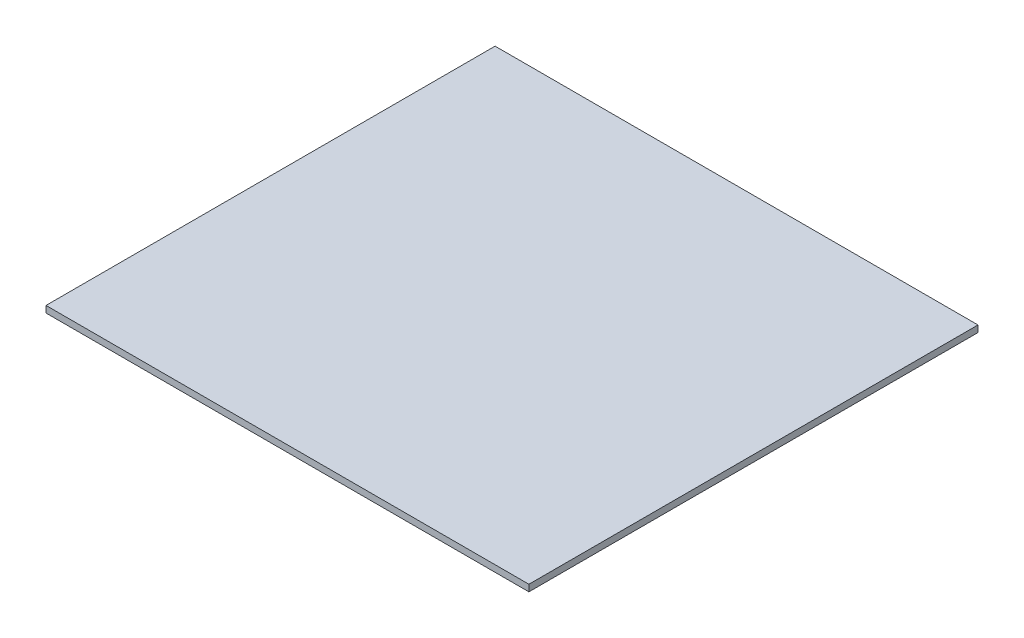
ISO-10303-21;
HEADER;
FILE_DESCRIPTION(('STEP AP214'),'2;1');
FILE_NAME('part.step','',(''),(''),'','','');
FILE_SCHEMA(('AUTOMOTIVE_DESIGN { 1 0 10303 214 1 1 1 1 }'));
ENDSEC;
DATA;
#1=APPLICATION_CONTEXT('core data for automotive mechanical design processes');
#2=APPLICATION_PROTOCOL_DEFINITION('international standard','automotive_design',2000,#1);
#3=PRODUCT_CONTEXT('',#1,'mechanical');
#4=PRODUCT('Part','Part','',(#3));
#5=PRODUCT_RELATED_PRODUCT_CATEGORY('part','',(#4));
#6=PRODUCT_DEFINITION_FORMATION('','',#4);
#7=PRODUCT_DEFINITION_CONTEXT('part definition',#1,'design');
#8=PRODUCT_DEFINITION('design','',#6,#7);
#9=PRODUCT_DEFINITION_SHAPE('','',#8);
#10=(LENGTH_UNIT() NAMED_UNIT(*) SI_UNIT(.MILLI.,.METRE.));
#11=(NAMED_UNIT(*) PLANE_ANGLE_UNIT() SI_UNIT($,.RADIAN.));
#12=(NAMED_UNIT(*) SI_UNIT($,.STERADIAN.) SOLID_ANGLE_UNIT());
#13=UNCERTAINTY_MEASURE_WITH_UNIT(LENGTH_MEASURE(1.E-05),#10,'distance_accuracy_value','');
#14=(GEOMETRIC_REPRESENTATION_CONTEXT(3) GLOBAL_UNCERTAINTY_ASSIGNED_CONTEXT((#13)) GLOBAL_UNIT_ASSIGNED_CONTEXT((#10,
#11,#12)) REPRESENTATION_CONTEXT('',''));
#15=CARTESIAN_POINT('',(0.,0.,0.));
#16=DIRECTION('',(0.,0.,1.));
#17=DIRECTION('',(1.,0.,0.));
#18=AXIS2_PLACEMENT_3D('',#15,#16,#17);
#19=CARTESIAN_POINT('',(0.,3.175,0.));
#20=DIRECTION('',(1.,0.,0.));
#21=DIRECTION('',(0.,0.,-1.));
#22=AXIS2_PLACEMENT_3D('',#19,#20,#21);
#23=PLANE('',#22);
#24=DIRECTION('',(0.,0.,1.));
#25=VECTOR('',#24,1.);
#26=CARTESIAN_POINT('',(0.,0.,0.));
#27=LINE('',#26,#25);
#28=CARTESIAN_POINT('',(0.,0.,-215.9));
#29=VERTEX_POINT('',#28);
#30=CARTESIAN_POINT('',(0.,0.,0.));
#31=VERTEX_POINT('',#30);
#32=EDGE_CURVE('E96',#29,#31,#27,.T.);
#33=ORIENTED_EDGE('',*,*,#32,.T.);
#34=DIRECTION('',(0.,-1.,0.));
#35=VECTOR('',#34,1.);
#36=CARTESIAN_POINT('',(0.,3.175,0.));
#37=LINE('',#36,#35);
#38=CARTESIAN_POINT('',(0.,3.175,0.));
#39=VERTEX_POINT('',#38);
#40=EDGE_CURVE('E11',#39,#31,#37,.T.);
#41=ORIENTED_EDGE('',*,*,#40,.F.);
#42=DIRECTION('',(0.,0.,1.));
#43=VECTOR('',#42,1.);
#44=CARTESIAN_POINT('',(0.,3.175,0.));
#45=LINE('',#44,#43);
#46=CARTESIAN_POINT('',(0.,3.175,-215.9));
#47=VERTEX_POINT('',#46);
#48=EDGE_CURVE('E84',#47,#39,#45,.T.);
#49=ORIENTED_EDGE('',*,*,#48,.F.);
#50=DIRECTION('',(0.,-1.,0.));
#51=VECTOR('',#50,1.);
#52=CARTESIAN_POINT('',(0.,3.175,-215.9));
#53=LINE('',#52,#51);
#54=EDGE_CURVE('E92',#47,#29,#53,.T.);
#55=ORIENTED_EDGE('',*,*,#54,.T.);
#56=EDGE_LOOP('',(#33,#41,#49,#55));
#57=FACE_BOUND('',#56,.T.);
#58=ADVANCED_FACE('F33',(#57),#23,.F.);
#59=CARTESIAN_POINT('',(0.,3.175,0.));
#60=DIRECTION('',(0.,0.,-1.));
#61=DIRECTION('',(-1.,0.,0.));
#62=AXIS2_PLACEMENT_3D('',#59,#60,#61);
#63=PLANE('',#62);
#64=DIRECTION('',(1.,0.,0.));
#65=VECTOR('',#64,1.);
#66=CARTESIAN_POINT('',(0.,0.,0.));
#67=LINE('',#66,#65);
#68=CARTESIAN_POINT('',(232.156,0.,0.));
#69=VERTEX_POINT('',#68);
#70=EDGE_CURVE('E88',#31,#69,#67,.T.);
#71=ORIENTED_EDGE('',*,*,#70,.T.);
#72=DIRECTION('',(0.,-1.,0.));
#73=VECTOR('',#72,1.);
#74=CARTESIAN_POINT('',(232.156,3.175,0.));
#75=LINE('',#74,#73);
#76=CARTESIAN_POINT('',(232.156,3.175,0.));
#77=VERTEX_POINT('',#76);
#78=EDGE_CURVE('E41',#77,#69,#75,.T.);
#79=ORIENTED_EDGE('',*,*,#78,.F.);
#80=DIRECTION('',(1.,0.,0.));
#81=VECTOR('',#80,1.);
#82=CARTESIAN_POINT('',(0.,3.175,0.));
#83=LINE('',#82,#81);
#84=EDGE_CURVE('E79',#39,#77,#83,.T.);
#85=ORIENTED_EDGE('',*,*,#84,.F.);
#86=ORIENTED_EDGE('',*,*,#40,.T.);
#87=EDGE_LOOP('',(#71,#79,#85,#86));
#88=FACE_BOUND('',#87,.T.);
#89=ADVANCED_FACE('F87',(#88),#63,.F.);
#90=CARTESIAN_POINT('',(232.156,3.175,-215.9));
#91=DIRECTION('',(-1.,0.,0.));
#92=DIRECTION('',(0.,0.,1.));
#93=AXIS2_PLACEMENT_3D('',#90,#91,#92);
#94=PLANE('',#93);
#95=DIRECTION('',(0.,0.,-1.));
#96=VECTOR('',#95,1.);
#97=CARTESIAN_POINT('',(232.156,0.,-215.9));
#98=LINE('',#97,#96);
#99=CARTESIAN_POINT('',(232.156,0.,-215.9));
#100=VERTEX_POINT('',#99);
#101=EDGE_CURVE('E66',#69,#100,#98,.T.);
#102=ORIENTED_EDGE('',*,*,#101,.T.);
#103=DIRECTION('',(0.,-1.,0.));
#104=VECTOR('',#103,1.);
#105=CARTESIAN_POINT('',(232.156,3.175,-215.9));
#106=LINE('',#105,#104);
#107=CARTESIAN_POINT('',(232.156,3.175,-215.9));
#108=VERTEX_POINT('',#107);
#109=EDGE_CURVE('E89',#108,#100,#106,.T.);
#110=ORIENTED_EDGE('',*,*,#109,.F.);
#111=DIRECTION('',(0.,0.,-1.));
#112=VECTOR('',#111,1.);
#113=CARTESIAN_POINT('',(232.156,3.175,-215.9));
#114=LINE('',#113,#112);
#115=EDGE_CURVE('E82',#77,#108,#114,.T.);
#116=ORIENTED_EDGE('',*,*,#115,.F.);
#117=ORIENTED_EDGE('',*,*,#78,.T.);
#118=EDGE_LOOP('',(#102,#110,#116,#117));
#119=FACE_BOUND('',#118,.T.);
#120=ADVANCED_FACE('F90',(#119),#94,.F.);
#121=CARTESIAN_POINT('',(0.,3.175,-215.9));
#122=DIRECTION('',(0.,0.,1.));
#123=DIRECTION('',(1.,0.,0.));
#124=AXIS2_PLACEMENT_3D('',#121,#122,#123);
#125=PLANE('',#124);
#126=DIRECTION('',(-1.,0.,0.));
#127=VECTOR('',#126,1.);
#128=CARTESIAN_POINT('',(0.,0.,-215.9));
#129=LINE('',#128,#127);
#130=EDGE_CURVE('E72',#100,#29,#129,.T.);
#131=ORIENTED_EDGE('',*,*,#130,.T.);
#132=ORIENTED_EDGE('',*,*,#54,.F.);
#133=DIRECTION('',(-1.,0.,0.));
#134=VECTOR('',#133,1.);
#135=CARTESIAN_POINT('',(0.,3.175,-215.9));
#136=LINE('',#135,#134);
#137=EDGE_CURVE('E49',#108,#47,#136,.T.);
#138=ORIENTED_EDGE('',*,*,#137,.F.);
#139=ORIENTED_EDGE('',*,*,#109,.T.);
#140=EDGE_LOOP('',(#131,#132,#138,#139));
#141=FACE_BOUND('',#140,.T.);
#142=ADVANCED_FACE('F103',(#141),#125,.F.);
#143=CARTESIAN_POINT('',(0.,3.175,0.));
#144=DIRECTION('',(0.,-1.,0.));
#145=DIRECTION('',(0.,0.,-1.));
#146=AXIS2_PLACEMENT_3D('',#143,#144,#145);
#147=PLANE('',#146);
#148=ORIENTED_EDGE('',*,*,#48,.T.);
#149=ORIENTED_EDGE('',*,*,#84,.T.);
#150=ORIENTED_EDGE('',*,*,#115,.T.);
#151=ORIENTED_EDGE('',*,*,#137,.T.);
#152=EDGE_LOOP('',(#148,#149,#150,#151));
#153=FACE_BOUND('',#152,.T.);
#154=ADVANCED_FACE('F80',(#153),#147,.F.);
#155=CARTESIAN_POINT('',(0.,0.,0.));
#156=DIRECTION('',(0.,-1.,0.));
#157=DIRECTION('',(0.,0.,-1.));
#158=AXIS2_PLACEMENT_3D('',#155,#156,#157);
#159=PLANE('',#158);
#160=ORIENTED_EDGE('',*,*,#32,.F.);
#161=ORIENTED_EDGE('',*,*,#130,.F.);
#162=ORIENTED_EDGE('',*,*,#101,.F.);
#163=ORIENTED_EDGE('',*,*,#70,.F.);
#164=EDGE_LOOP('',(#160,#161,#162,#163));
#165=FACE_BOUND('',#164,.T.);
#166=ADVANCED_FACE('F106',(#165),#159,.T.);
#167=CLOSED_SHELL('',(#58,#89,#120,#142,#154,#166));
#168=MANIFOLD_SOLID_BREP('B2',#167);
#169=ADVANCED_BREP_SHAPE_REPRESENTATION('',(#18,#168),#14);
#170=SHAPE_DEFINITION_REPRESENTATION(#9,#169);
ENDSEC;
END-ISO-10303-21;
